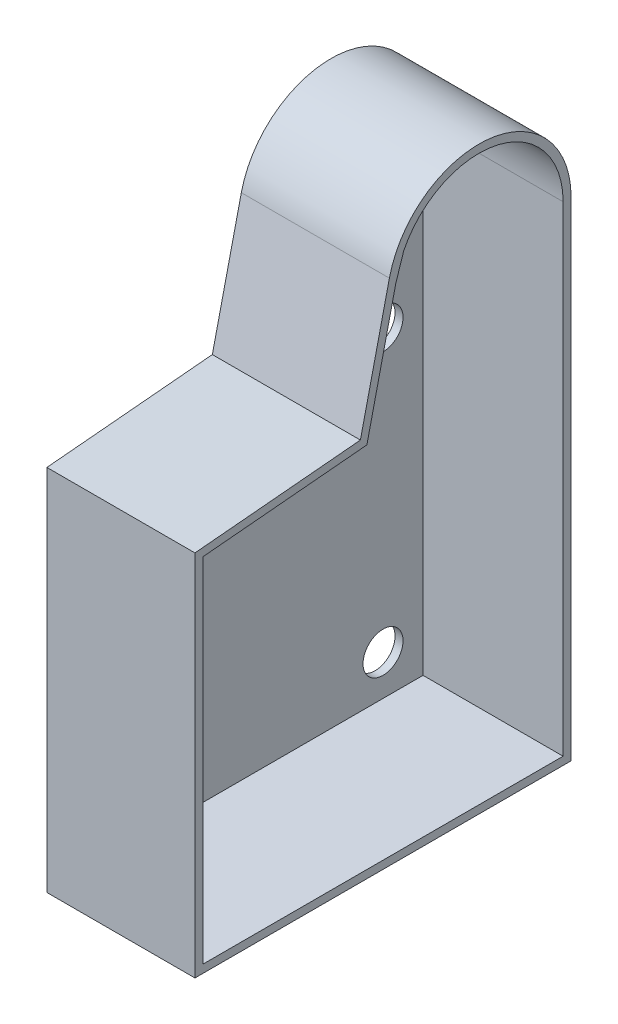
ISO-10303-21;
HEADER;
FILE_DESCRIPTION(('STEP AP214'),'2;1');
FILE_NAME('part.step','',(''),(''),'','','');
FILE_SCHEMA(('AUTOMOTIVE_DESIGN { 1 0 10303 214 1 1 1 1 }'));
ENDSEC;
DATA;
#1=APPLICATION_CONTEXT('core data for automotive mechanical design processes');
#2=APPLICATION_PROTOCOL_DEFINITION('international standard','automotive_design',2000,#1);
#3=PRODUCT_CONTEXT('',#1,'mechanical');
#4=PRODUCT('Part','Part','',(#3));
#5=PRODUCT_RELATED_PRODUCT_CATEGORY('part','',(#4));
#6=PRODUCT_DEFINITION_FORMATION('','',#4);
#7=PRODUCT_DEFINITION_CONTEXT('part definition',#1,'design');
#8=PRODUCT_DEFINITION('design','',#6,#7);
#9=PRODUCT_DEFINITION_SHAPE('','',#8);
#10=(LENGTH_UNIT() NAMED_UNIT(*) SI_UNIT(.MILLI.,.METRE.));
#11=(NAMED_UNIT(*) PLANE_ANGLE_UNIT() SI_UNIT($,.RADIAN.));
#12=(NAMED_UNIT(*) SI_UNIT($,.STERADIAN.) SOLID_ANGLE_UNIT());
#13=UNCERTAINTY_MEASURE_WITH_UNIT(LENGTH_MEASURE(1.E-05),#10,'distance_accuracy_value','');
#14=(GEOMETRIC_REPRESENTATION_CONTEXT(3) GLOBAL_UNCERTAINTY_ASSIGNED_CONTEXT((#13)) GLOBAL_UNIT_ASSIGNED_CONTEXT((#10,
#11,#12)) REPRESENTATION_CONTEXT('',''));
#15=CARTESIAN_POINT('',(0.,0.,0.));
#16=DIRECTION('',(0.,0.,1.));
#17=DIRECTION('',(1.,0.,0.));
#18=AXIS2_PLACEMENT_3D('',#15,#16,#17);
#19=CARTESIAN_POINT('',(0.,62.2628402000038,-26.0439329469259));
#20=DIRECTION('',(1.,0.,0.));
#21=DIRECTION('',(0.,0.,-1.));
#22=AXIS2_PLACEMENT_3D('',#19,#20,#21);
#23=PLANE('',#22);
#24=CARTESIAN_POINT('',(0.,22.2628402000404,-37.0439329470368));
#25=DIRECTION('',(1.,0.,0.));
#26=DIRECTION('',(0.,0.,-1.));
#27=AXIS2_PLACEMENT_3D('',#24,#25,#26);
#28=CIRCLE('',#27,5.00000000000455);
#29=CARTESIAN_POINT('',(0.,22.2628402000404,-42.0439329470414));
#30=VERTEX_POINT('',#29);
#31=EDGE_CURVE('E271',#30,#30,#28,.T.);
#32=ORIENTED_EDGE('',*,*,#31,.F.);
#33=EDGE_LOOP('',(#32));
#34=FACE_BOUND('',#33,.T.);
#35=CARTESIAN_POINT('',(0.,-47.7371597999596,-37.0439329470368));
#36=DIRECTION('',(1.,0.,0.));
#37=DIRECTION('',(0.,0.,-1.));
#38=AXIS2_PLACEMENT_3D('',#35,#36,#37);
#39=CIRCLE('',#38,5.00000000000458);
#40=CARTESIAN_POINT('',(0.,-47.7371597999596,-42.0439329470414));
#41=VERTEX_POINT('',#40);
#42=EDGE_CURVE('E265',#41,#41,#39,.T.);
#43=ORIENTED_EDGE('',*,*,#42,.F.);
#44=EDGE_LOOP('',(#43));
#45=FACE_BOUND('',#44,.T.);
#46=CARTESIAN_POINT('',(0.,-47.7371597999596,32.9560670529632));
#47=DIRECTION('',(1.,0.,0.));
#48=DIRECTION('',(0.,0.,-1.));
#49=AXIS2_PLACEMENT_3D('',#46,#47,#48);
#50=CIRCLE('',#49,5.00000000000456);
#51=CARTESIAN_POINT('',(0.,-47.7371597999596,27.9560670529586));
#52=VERTEX_POINT('',#51);
#53=EDGE_CURVE('E259',#52,#52,#50,.T.);
#54=ORIENTED_EDGE('',*,*,#53,.F.);
#55=EDGE_LOOP('',(#54));
#56=FACE_BOUND('',#55,.T.);
#57=CARTESIAN_POINT('',(0.,22.2628402000404,32.9560670529632));
#58=DIRECTION('',(1.,0.,0.));
#59=DIRECTION('',(0.,0.,-1.));
#60=AXIS2_PLACEMENT_3D('',#57,#58,#59);
#61=CIRCLE('',#60,5.00000000000456);
#62=CARTESIAN_POINT('',(0.,22.2628402000404,27.9560670529586));
#63=VERTEX_POINT('',#62);
#64=EDGE_CURVE('E242',#63,#63,#61,.T.);
#65=ORIENTED_EDGE('',*,*,#64,.F.);
#66=EDGE_LOOP('',(#65));
#67=FACE_BOUND('',#66,.T.);
#68=CARTESIAN_POINT('',(0.,62.2628402000038,-26.0439329469259));
#69=DIRECTION('',(1.,0.,0.));
#70=DIRECTION('',(0.,0.,-1.));
#71=AXIS2_PLACEMENT_3D('',#68,#69,#70);
#72=CIRCLE('',#71,21.000000000111);
#73=CARTESIAN_POINT('',(0.,71.5718826042402,-7.21996605573128));
#74=VERTEX_POINT('',#73);
#75=CARTESIAN_POINT('',(0.,62.2628402000404,-47.0439329470368));
#76=VERTEX_POINT('',#75);
#77=EDGE_CURVE('E224',#74,#76,#72,.F.);
#78=ORIENTED_EDGE('',*,*,#77,.F.);
#79=DIRECTION('',(0.,0.950386311679285,-0.311072111531465));
#80=VECTOR('',#79,1.);
#81=CARTESIAN_POINT('',(0.,65.5698078906343,-5.25541960573879));
#82=LINE('',#81,#80);
#83=CARTESIAN_POINT('',(0.,65.5698078906343,-5.2554196057388));
#84=VERTEX_POINT('',#83);
#85=EDGE_CURVE('E247',#84,#74,#82,.T.);
#86=ORIENTED_EDGE('',*,*,#85,.F.);
#87=DIRECTION('',(0.,0.974430327879,-0.224689866504087));
#88=VECTOR('',#87,1.);
#89=CARTESIAN_POINT('',(0.,35.5653537495854,1.66318360538522));
#90=LINE('',#89,#88);
#91=CARTESIAN_POINT('',(0.,34.1538342436052,1.98866006100515));
#92=VERTEX_POINT('',#91);
#93=EDGE_CURVE('E221',#92,#84,#90,.T.);
#94=ORIENTED_EDGE('',*,*,#93,.F.);
#95=DIRECTION('',(0.,0.0903767692441889,-0.995907646110312));
#96=VECTOR('',#95,1.);
#97=CARTESIAN_POINT('',(0.,30.4361181454251,42.9560670529631));
#98=LINE('',#97,#96);
#99=CARTESIAN_POINT('',(0.,30.4361181454251,42.9560670529631));
#100=VERTEX_POINT('',#99);
#101=EDGE_CURVE('E250',#100,#92,#98,.T.);
#102=ORIENTED_EDGE('',*,*,#101,.F.);
#103=DIRECTION('',(0.,1.,0.));
#104=VECTOR('',#103,1.);
#105=CARTESIAN_POINT('',(0.,-59.7371597999596,42.9560670529631));
#106=LINE('',#105,#104);
#107=CARTESIAN_POINT('',(0.,-57.7371597999596,42.9560670529631));
#108=VERTEX_POINT('',#107);
#109=EDGE_CURVE('E91',#108,#100,#106,.T.);
#110=ORIENTED_EDGE('',*,*,#109,.F.);
#111=DIRECTION('',(0.,0.,1.));
#112=VECTOR('',#111,1.);
#113=CARTESIAN_POINT('',(0.,-57.7371597999596,-49.0439329470368));
#114=LINE('',#113,#112);
#115=CARTESIAN_POINT('',(0.,-57.7371597999596,-47.0439329470368));
#116=VERTEX_POINT('',#115);
#117=EDGE_CURVE('E202',#116,#108,#114,.T.);
#118=ORIENTED_EDGE('',*,*,#117,.F.);
#119=DIRECTION('',(0.,1.,0.));
#120=VECTOR('',#119,1.);
#121=CARTESIAN_POINT('',(0.,-59.7371597999596,-47.0439329470368));
#122=LINE('',#121,#120);
#123=EDGE_CURVE('E226',#76,#116,#122,.F.);
#124=ORIENTED_EDGE('',*,*,#123,.F.);
#125=EDGE_LOOP('',(#78,#86,#94,#102,#110,#118,#124));
#126=FACE_BOUND('',#125,.T.);
#127=ADVANCED_FACE('F74',(#34,#45,#56,#67,#126),#23,.T.);
#128=CARTESIAN_POINT('',(-2.,-59.7371597999596,-49.0439329470368));
#129=DIRECTION('',(0.,0.,-1.));
#130=DIRECTION('',(-1.,0.,0.));
#131=AXIS2_PLACEMENT_3D('',#128,#129,#130);
#132=PLANE('',#131);
#133=DIRECTION('',(1.,0.,0.));
#134=VECTOR('',#133,1.);
#135=CARTESIAN_POINT('',(-2.,62.2628402000404,-49.0439329470368));
#136=LINE('',#135,#134);
#137=CARTESIAN_POINT('',(-2.,62.2628402000404,-49.0439329470368));
#138=VERTEX_POINT('',#137);
#139=CARTESIAN_POINT('',(35.,62.2628402000404,-49.0439329470368));
#140=VERTEX_POINT('',#139);
#141=EDGE_CURVE('E78',#138,#140,#136,.T.);
#142=ORIENTED_EDGE('',*,*,#141,.T.);
#143=DIRECTION('',(0.,-1.,0.));
#144=VECTOR('',#143,1.);
#145=CARTESIAN_POINT('',(35.,-59.7371597999596,-49.0439329470368));
#146=LINE('',#145,#144);
#147=CARTESIAN_POINT('',(35.,-59.7371597999596,-49.0439329470368));
#148=VERTEX_POINT('',#147);
#149=EDGE_CURVE('E199',#140,#148,#146,.T.);
#150=ORIENTED_EDGE('',*,*,#149,.T.);
#151=DIRECTION('',(1.,0.,0.));
#152=VECTOR('',#151,1.);
#153=CARTESIAN_POINT('',(-2.,-59.7371597999596,-49.0439329470368));
#154=LINE('',#153,#152);
#155=CARTESIAN_POINT('',(-2.,-59.7371597999596,-49.0439329470368));
#156=VERTEX_POINT('',#155);
#157=EDGE_CURVE('E12',#156,#148,#154,.T.);
#158=ORIENTED_EDGE('',*,*,#157,.F.);
#159=DIRECTION('',(0.,1.,0.));
#160=VECTOR('',#159,1.);
#161=CARTESIAN_POINT('',(-2.,-59.7371597999596,-49.0439329470368));
#162=LINE('',#161,#160);
#163=EDGE_CURVE('E277',#156,#138,#162,.T.);
#164=ORIENTED_EDGE('',*,*,#163,.T.);
#165=EDGE_LOOP('',(#142,#150,#158,#164));
#166=FACE_BOUND('',#165,.T.);
#167=ADVANCED_FACE('F76',(#166),#132,.T.);
#168=CARTESIAN_POINT('',(-2.,-59.7371597999596,-49.0439329470368));
#169=DIRECTION('',(0.,-1.,0.));
#170=DIRECTION('',(0.,0.,-1.));
#171=AXIS2_PLACEMENT_3D('',#168,#169,#170);
#172=PLANE('',#171);
#173=ORIENTED_EDGE('',*,*,#157,.T.);
#174=DIRECTION('',(0.,0.,1.));
#175=VECTOR('',#174,1.);
#176=CARTESIAN_POINT('',(35.,-59.7371597999596,-49.0439329470368));
#177=LINE('',#176,#175);
#178=CARTESIAN_POINT('',(35.,-59.7371597999596,44.9560670529631));
#179=VERTEX_POINT('',#178);
#180=EDGE_CURVE('E196',#148,#179,#177,.T.);
#181=ORIENTED_EDGE('',*,*,#180,.T.);
#182=DIRECTION('',(1.,0.,0.));
#183=VECTOR('',#182,1.);
#184=CARTESIAN_POINT('',(-2.,-59.7371597999596,44.9560670529631));
#185=LINE('',#184,#183);
#186=CARTESIAN_POINT('',(-2.,-59.7371597999596,44.9560670529631));
#187=VERTEX_POINT('',#186);
#188=EDGE_CURVE('E83',#187,#179,#185,.T.);
#189=ORIENTED_EDGE('',*,*,#188,.F.);
#190=DIRECTION('',(0.,0.,-1.));
#191=VECTOR('',#190,1.);
#192=CARTESIAN_POINT('',(-2.,-59.7371597999596,-49.0439329470368));
#193=LINE('',#192,#191);
#194=EDGE_CURVE('E290',#187,#156,#193,.T.);
#195=ORIENTED_EDGE('',*,*,#194,.T.);
#196=EDGE_LOOP('',(#173,#181,#189,#195));
#197=FACE_BOUND('',#196,.T.);
#198=ADVANCED_FACE('F300',(#197),#172,.T.);
#199=CARTESIAN_POINT('',(-2.,-59.7371597999596,44.9560670529631));
#200=DIRECTION('',(0.,0.,1.));
#201=DIRECTION('',(1.,0.,0.));
#202=AXIS2_PLACEMENT_3D('',#199,#200,#201);
#203=PLANE('',#202);
#204=ORIENTED_EDGE('',*,*,#188,.T.);
#205=DIRECTION('',(0.,1.,0.));
#206=VECTOR('',#205,1.);
#207=CARTESIAN_POINT('',(35.,-59.7371597999596,44.9560670529631));
#208=LINE('',#207,#206);
#209=CARTESIAN_POINT('',(35.,32.2628402000423,44.9560670529631));
#210=VERTEX_POINT('',#209);
#211=EDGE_CURVE('E189',#179,#210,#208,.T.);
#212=ORIENTED_EDGE('',*,*,#211,.T.);
#213=DIRECTION('',(1.,0.,0.));
#214=VECTOR('',#213,1.);
#215=CARTESIAN_POINT('',(-2.,32.2628402000423,44.9560670529631));
#216=LINE('',#215,#214);
#217=CARTESIAN_POINT('',(-2.,32.2628402000423,44.9560670529631));
#218=VERTEX_POINT('',#217);
#219=EDGE_CURVE('E171',#218,#210,#216,.T.);
#220=ORIENTED_EDGE('',*,*,#219,.F.);
#221=DIRECTION('',(0.,-1.,0.));
#222=VECTOR('',#221,1.);
#223=CARTESIAN_POINT('',(-2.,-59.7371597999596,44.9560670529631));
#224=LINE('',#223,#222);
#225=EDGE_CURVE('E288',#218,#187,#224,.T.);
#226=ORIENTED_EDGE('',*,*,#225,.T.);
#227=EDGE_LOOP('',(#204,#212,#220,#226));
#228=FACE_BOUND('',#227,.T.);
#229=ADVANCED_FACE('F195',(#228),#203,.T.);
#230=CARTESIAN_POINT('',(-2.,32.2628402000423,44.9560670529631));
#231=DIRECTION('',(0.,0.995907646110312,0.0903767692441889));
#232=DIRECTION('',(0.,-0.090376769244189,0.995907646110312));
#233=AXIS2_PLACEMENT_3D('',#230,#231,#232);
#234=PLANE('',#233);
#235=ORIENTED_EDGE('',*,*,#219,.T.);
#236=DIRECTION('',(0.,0.0903767692441889,-0.995907646110312));
#237=VECTOR('',#236,1.);
#238=CARTESIAN_POINT('',(35.,32.4279334376457,43.1368205914515));
#239=LINE('',#238,#237);
#240=CARTESIAN_POINT('',(35.,36.0147334825936,3.61204426114322));
#241=VERTEX_POINT('',#240);
#242=EDGE_CURVE('E174',#210,#241,#239,.T.);
#243=ORIENTED_EDGE('',*,*,#242,.T.);
#244=DIRECTION('',(1.,0.,0.));
#245=VECTOR('',#244,1.);
#246=CARTESIAN_POINT('',(-2.,36.0147334825936,3.61204426114322));
#247=LINE('',#246,#245);
#248=CARTESIAN_POINT('',(-2.,36.0147334825936,3.61204426114322));
#249=VERTEX_POINT('',#248);
#250=EDGE_CURVE('E182',#249,#241,#247,.T.);
#251=ORIENTED_EDGE('',*,*,#250,.F.);
#252=DIRECTION('',(0.,-0.090376769244189,0.995907646110312));
#253=VECTOR('',#252,1.);
#254=CARTESIAN_POINT('',(-2.,32.2628402000423,44.9560670529631));
#255=LINE('',#254,#253);
#256=EDGE_CURVE('E177',#249,#218,#255,.T.);
#257=ORIENTED_EDGE('',*,*,#256,.T.);
#258=EDGE_LOOP('',(#235,#243,#251,#257));
#259=FACE_BOUND('',#258,.T.);
#260=ADVANCED_FACE('F173',(#259),#234,.T.);
#261=CARTESIAN_POINT('',(-2.,67.4307071296228,-3.63203540560073));
#262=DIRECTION('',(0.,0.224689866504087,0.974430327879));
#263=DIRECTION('',(0.,-0.974430327879,0.224689866504087));
#264=AXIS2_PLACEMENT_3D('',#261,#262,#263);
#265=PLANE('',#264);
#266=ORIENTED_EDGE('',*,*,#250,.T.);
#267=DIRECTION('',(0.,0.974430327879,-0.224689866504087));
#268=VECTOR('',#267,1.);
#269=CARTESIAN_POINT('',(35.,36.0147334825936,3.61204426114322));
#270=LINE('',#269,#268);
#271=CARTESIAN_POINT('',(35.,67.4307071296228,-3.63203540560073));
#272=VERTEX_POINT('',#271);
#273=EDGE_CURVE('E192',#241,#272,#270,.T.);
#274=ORIENTED_EDGE('',*,*,#273,.T.);
#275=DIRECTION('',(1.,0.,0.));
#276=VECTOR('',#275,1.);
#277=CARTESIAN_POINT('',(-2.,67.4307071296228,-3.63203540560073));
#278=LINE('',#277,#276);
#279=CARTESIAN_POINT('',(-2.,67.4307071296228,-3.63203540560073));
#280=VERTEX_POINT('',#279);
#281=EDGE_CURVE('E294',#280,#272,#278,.T.);
#282=ORIENTED_EDGE('',*,*,#281,.F.);
#283=DIRECTION('',(0.,-0.974430327879,0.224689866504087));
#284=VECTOR('',#283,1.);
#285=CARTESIAN_POINT('',(-2.,67.4307071296228,-3.63203540560073));
#286=LINE('',#285,#284);
#287=EDGE_CURVE('E284',#280,#249,#286,.T.);
#288=ORIENTED_EDGE('',*,*,#287,.T.);
#289=EDGE_LOOP('',(#266,#274,#282,#288));
#290=FACE_BOUND('',#289,.T.);
#291=ADVANCED_FACE('F306',(#290),#265,.T.);
#292=CARTESIAN_POINT('',(-2.,62.2628402000038,-26.0439329469259));
#293=DIRECTION('',(1.,0.,0.));
#294=DIRECTION('',(0.,0.,-1.));
#295=AXIS2_PLACEMENT_3D('',#292,#293,#294);
#296=CYLINDRICAL_SURFACE('',#295,23.000000000111);
#297=ORIENTED_EDGE('',*,*,#281,.T.);
#298=CARTESIAN_POINT('',(35.,62.2628402000038,-26.0439329469259));
#299=DIRECTION('',(-1.,0.,0.));
#300=DIRECTION('',(0.,0.,-1.));
#301=AXIS2_PLACEMENT_3D('',#298,#299,#300);
#302=CIRCLE('',#301,23.000000000111);
#303=EDGE_CURVE('E206',#272,#140,#302,.T.);
#304=ORIENTED_EDGE('',*,*,#303,.T.);
#305=ORIENTED_EDGE('',*,*,#141,.F.);
#306=CARTESIAN_POINT('',(-2.,62.2628402000038,-26.0439329469259));
#307=DIRECTION('',(1.,0.,0.));
#308=DIRECTION('',(0.,0.,-1.));
#309=AXIS2_PLACEMENT_3D('',#306,#307,#308);
#310=CIRCLE('',#309,23.000000000111);
#311=EDGE_CURVE('E281',#138,#280,#310,.T.);
#312=ORIENTED_EDGE('',*,*,#311,.T.);
#313=EDGE_LOOP('',(#297,#304,#305,#312));
#314=FACE_BOUND('',#313,.T.);
#315=ADVANCED_FACE('F298',(#314),#296,.T.);
#316=CARTESIAN_POINT('',(-2.,62.2628402000038,-26.0439329469259));
#317=DIRECTION('',(1.,0.,0.));
#318=DIRECTION('',(0.,0.,-1.));
#319=AXIS2_PLACEMENT_3D('',#316,#317,#318);
#320=PLANE('',#319);
#321=CARTESIAN_POINT('',(-2.,22.2628402000404,32.9560670529632));
#322=DIRECTION('',(1.,0.,0.));
#323=DIRECTION('',(0.,0.,-1.));
#324=AXIS2_PLACEMENT_3D('',#321,#322,#323);
#325=CIRCLE('',#324,5.00000000000456);
#326=CARTESIAN_POINT('',(-2.,22.2628402000404,27.9560670529586));
#327=VERTEX_POINT('',#326);
#328=EDGE_CURVE('E256',#327,#327,#325,.T.);
#329=ORIENTED_EDGE('',*,*,#328,.T.);
#330=EDGE_LOOP('',(#329));
#331=FACE_BOUND('',#330,.T.);
#332=CARTESIAN_POINT('',(-2.,-47.7371597999596,32.9560670529632));
#333=DIRECTION('',(1.,0.,0.));
#334=DIRECTION('',(0.,0.,-1.));
#335=AXIS2_PLACEMENT_3D('',#332,#333,#334);
#336=CIRCLE('',#335,5.00000000000456);
#337=CARTESIAN_POINT('',(-2.,-47.7371597999596,27.9560670529586));
#338=VERTEX_POINT('',#337);
#339=EDGE_CURVE('E262',#338,#338,#336,.T.);
#340=ORIENTED_EDGE('',*,*,#339,.T.);
#341=EDGE_LOOP('',(#340));
#342=FACE_BOUND('',#341,.T.);
#343=CARTESIAN_POINT('',(-2.,-47.7371597999596,-37.0439329470368));
#344=DIRECTION('',(1.,0.,0.));
#345=DIRECTION('',(0.,0.,-1.));
#346=AXIS2_PLACEMENT_3D('',#343,#344,#345);
#347=CIRCLE('',#346,5.00000000000458);
#348=CARTESIAN_POINT('',(-2.,-47.7371597999596,-42.0439329470414));
#349=VERTEX_POINT('',#348);
#350=EDGE_CURVE('E268',#349,#349,#347,.T.);
#351=ORIENTED_EDGE('',*,*,#350,.T.);
#352=EDGE_LOOP('',(#351));
#353=FACE_BOUND('',#352,.T.);
#354=CARTESIAN_POINT('',(-2.,22.2628402000404,-37.0439329470368));
#355=DIRECTION('',(1.,0.,0.));
#356=DIRECTION('',(0.,0.,-1.));
#357=AXIS2_PLACEMENT_3D('',#354,#355,#356);
#358=CIRCLE('',#357,5.00000000000455);
#359=CARTESIAN_POINT('',(-2.,22.2628402000404,-42.0439329470414));
#360=VERTEX_POINT('',#359);
#361=EDGE_CURVE('E274',#360,#360,#358,.T.);
#362=ORIENTED_EDGE('',*,*,#361,.T.);
#363=EDGE_LOOP('',(#362));
#364=FACE_BOUND('',#363,.T.);
#365=ORIENTED_EDGE('',*,*,#163,.F.);
#366=ORIENTED_EDGE('',*,*,#194,.F.);
#367=ORIENTED_EDGE('',*,*,#225,.F.);
#368=ORIENTED_EDGE('',*,*,#256,.F.);
#369=ORIENTED_EDGE('',*,*,#287,.F.);
#370=ORIENTED_EDGE('',*,*,#311,.F.);
#371=EDGE_LOOP('',(#365,#366,#367,#368,#369,#370));
#372=FACE_BOUND('',#371,.T.);
#373=ADVANCED_FACE('F303',(#331,#342,#353,#364,#372),#320,.F.);
#374=CARTESIAN_POINT('',(-2.,22.2628402000404,-37.0439329470368));
#375=DIRECTION('',(1.,0.,0.));
#376=DIRECTION('',(0.,0.,-1.));
#377=AXIS2_PLACEMENT_3D('',#374,#375,#376);
#378=CYLINDRICAL_SURFACE('',#377,5.00000000000455);
#379=ORIENTED_EDGE('',*,*,#361,.F.);
#380=EDGE_LOOP('',(#379));
#381=FACE_BOUND('',#380,.T.);
#382=ORIENTED_EDGE('',*,*,#31,.T.);
#383=EDGE_LOOP('',(#382));
#384=FACE_BOUND('',#383,.T.);
#385=ADVANCED_FACE('F448',(#381,#384),#378,.F.);
#386=CARTESIAN_POINT('',(-2.,-47.7371597999596,-37.0439329470368));
#387=DIRECTION('',(1.,0.,0.));
#388=DIRECTION('',(0.,0.,-1.));
#389=AXIS2_PLACEMENT_3D('',#386,#387,#388);
#390=CYLINDRICAL_SURFACE('',#389,5.00000000000458);
#391=ORIENTED_EDGE('',*,*,#350,.F.);
#392=EDGE_LOOP('',(#391));
#393=FACE_BOUND('',#392,.T.);
#394=ORIENTED_EDGE('',*,*,#42,.T.);
#395=EDGE_LOOP('',(#394));
#396=FACE_BOUND('',#395,.T.);
#397=ADVANCED_FACE('F445',(#393,#396),#390,.F.);
#398=CARTESIAN_POINT('',(-2.,-47.7371597999596,32.9560670529632));
#399=DIRECTION('',(1.,0.,0.));
#400=DIRECTION('',(0.,0.,-1.));
#401=AXIS2_PLACEMENT_3D('',#398,#399,#400);
#402=CYLINDRICAL_SURFACE('',#401,5.00000000000456);
#403=ORIENTED_EDGE('',*,*,#339,.F.);
#404=EDGE_LOOP('',(#403));
#405=FACE_BOUND('',#404,.T.);
#406=ORIENTED_EDGE('',*,*,#53,.T.);
#407=EDGE_LOOP('',(#406));
#408=FACE_BOUND('',#407,.T.);
#409=ADVANCED_FACE('F441',(#405,#408),#402,.F.);
#410=CARTESIAN_POINT('',(-2.,22.2628402000404,32.9560670529632));
#411=DIRECTION('',(1.,0.,0.));
#412=DIRECTION('',(0.,0.,-1.));
#413=AXIS2_PLACEMENT_3D('',#410,#411,#412);
#414=CYLINDRICAL_SURFACE('',#413,5.00000000000456);
#415=ORIENTED_EDGE('',*,*,#328,.F.);
#416=EDGE_LOOP('',(#415));
#417=FACE_BOUND('',#416,.T.);
#418=ORIENTED_EDGE('',*,*,#64,.T.);
#419=EDGE_LOOP('',(#418));
#420=FACE_BOUND('',#419,.T.);
#421=ADVANCED_FACE('F362',(#417,#420),#414,.F.);
#422=CARTESIAN_POINT('',(35.,35.5653537495854,1.66318360538522));
#423=DIRECTION('',(0.,0.224689866504087,0.974430327879));
#424=DIRECTION('',(0.,-0.974430327879,0.224689866504087));
#425=AXIS2_PLACEMENT_3D('',#422,#423,#424);
#426=PLANE('',#425);
#427=DIRECTION('',(-1.,0.,0.));
#428=VECTOR('',#427,1.);
#429=CARTESIAN_POINT('',(35.,65.5698078906343,-5.2554196057388));
#430=LINE('',#429,#428);
#431=CARTESIAN_POINT('',(35.,65.5698078906343,-5.2554196057388));
#432=VERTEX_POINT('',#431);
#433=EDGE_CURVE('E238',#432,#84,#430,.T.);
#434=ORIENTED_EDGE('',*,*,#433,.F.);
#435=DIRECTION('',(0.,0.974430327879,-0.224689866504087));
#436=VECTOR('',#435,1.);
#437=CARTESIAN_POINT('',(35.,35.5653537495854,1.66318360538522));
#438=LINE('',#437,#436);
#439=CARTESIAN_POINT('',(35.,34.1538342436052,1.98866006100515));
#440=VERTEX_POINT('',#439);
#441=EDGE_CURVE('E210',#440,#432,#438,.T.);
#442=ORIENTED_EDGE('',*,*,#441,.F.);
#443=DIRECTION('',(-1.,0.,0.));
#444=VECTOR('',#443,1.);
#445=CARTESIAN_POINT('',(35.,34.1538342436052,1.98866006100515));
#446=LINE('',#445,#444);
#447=EDGE_CURVE('E193',#440,#92,#446,.T.);
#448=ORIENTED_EDGE('',*,*,#447,.T.);
#449=ORIENTED_EDGE('',*,*,#93,.T.);
#450=EDGE_LOOP('',(#434,#442,#448,#449));
#451=FACE_BOUND('',#450,.T.);
#452=ADVANCED_FACE('F356',(#451),#426,.F.);
#453=CARTESIAN_POINT('',(35.,62.2628402000038,-26.0439329469259));
#454=DIRECTION('',(-1.,0.,0.));
#455=DIRECTION('',(0.,0.,1.));
#456=AXIS2_PLACEMENT_3D('',#453,#454,#455);
#457=CYLINDRICAL_SURFACE('',#456,21.000000000111);
#458=DIRECTION('',(-1.,0.,0.));
#459=VECTOR('',#458,1.);
#460=CARTESIAN_POINT('',(35.,71.5718826042402,-7.2199660557313));
#461=LINE('',#460,#459);
#462=CARTESIAN_POINT('',(35.,71.5718826042402,-7.21996605573128));
#463=VERTEX_POINT('',#462);
#464=EDGE_CURVE('E236',#74,#463,#461,.F.);
#465=ORIENTED_EDGE('',*,*,#464,.F.);
#466=ORIENTED_EDGE('',*,*,#77,.T.);
#467=DIRECTION('',(-1.,0.,0.));
#468=VECTOR('',#467,1.);
#469=CARTESIAN_POINT('',(35.,62.2628402000404,-47.0439329470368));
#470=LINE('',#469,#468);
#471=CARTESIAN_POINT('',(35.,62.2628402000404,-47.0439329470368));
#472=VERTEX_POINT('',#471);
#473=EDGE_CURVE('E233',#472,#76,#470,.T.);
#474=ORIENTED_EDGE('',*,*,#473,.F.);
#475=CARTESIAN_POINT('',(35.,62.2628402000038,-26.0439329469259));
#476=DIRECTION('',(1.,0.,0.));
#477=DIRECTION('',(0.,0.,-1.));
#478=AXIS2_PLACEMENT_3D('',#475,#476,#477);
#479=CIRCLE('',#478,21.000000000111);
#480=EDGE_CURVE('E213',#463,#472,#479,.F.);
#481=ORIENTED_EDGE('',*,*,#480,.F.);
#482=EDGE_LOOP('',(#465,#466,#474,#481));
#483=FACE_BOUND('',#482,.T.);
#484=ADVANCED_FACE('F361',(#483),#457,.F.);
#485=CARTESIAN_POINT('',(35.,-59.7371597999596,-47.0439329470368));
#486=DIRECTION('',(0.,0.,-1.));
#487=DIRECTION('',(-1.,0.,0.));
#488=AXIS2_PLACEMENT_3D('',#485,#486,#487);
#489=PLANE('',#488);
#490=ORIENTED_EDGE('',*,*,#123,.T.);
#491=DIRECTION('',(-1.,0.,0.));
#492=VECTOR('',#491,1.);
#493=CARTESIAN_POINT('',(35.,-57.7371597999596,-47.0439329470368));
#494=LINE('',#493,#492);
#495=CARTESIAN_POINT('',(35.,-57.7371597999596,-47.0439329470368));
#496=VERTEX_POINT('',#495);
#497=EDGE_CURVE('E230',#496,#116,#494,.T.);
#498=ORIENTED_EDGE('',*,*,#497,.F.);
#499=DIRECTION('',(0.,1.,0.));
#500=VECTOR('',#499,1.);
#501=CARTESIAN_POINT('',(35.,-59.7371597999596,-47.0439329470368));
#502=LINE('',#501,#500);
#503=EDGE_CURVE('E215',#472,#496,#502,.F.);
#504=ORIENTED_EDGE('',*,*,#503,.F.);
#505=ORIENTED_EDGE('',*,*,#473,.T.);
#506=EDGE_LOOP('',(#490,#498,#504,#505));
#507=FACE_BOUND('',#506,.T.);
#508=ADVANCED_FACE('F374',(#507),#489,.F.);
#509=CARTESIAN_POINT('',(35.,-57.7371597999596,-49.0439329470368));
#510=DIRECTION('',(0.,-1.,0.));
#511=DIRECTION('',(0.,0.,-1.));
#512=AXIS2_PLACEMENT_3D('',#509,#510,#511);
#513=PLANE('',#512);
#514=ORIENTED_EDGE('',*,*,#117,.T.);
#515=DIRECTION('',(-1.,0.,0.));
#516=VECTOR('',#515,1.);
#517=CARTESIAN_POINT('',(35.,-57.7371597999596,42.9560670529631));
#518=LINE('',#517,#516);
#519=CARTESIAN_POINT('',(35.,-57.7371597999596,42.9560670529631));
#520=VERTEX_POINT('',#519);
#521=EDGE_CURVE('E219',#520,#108,#518,.T.);
#522=ORIENTED_EDGE('',*,*,#521,.F.);
#523=DIRECTION('',(0.,0.,1.));
#524=VECTOR('',#523,1.);
#525=CARTESIAN_POINT('',(35.,-57.7371597999596,-49.0439329470368));
#526=LINE('',#525,#524);
#527=EDGE_CURVE('E217',#496,#520,#526,.T.);
#528=ORIENTED_EDGE('',*,*,#527,.F.);
#529=ORIENTED_EDGE('',*,*,#497,.T.);
#530=EDGE_LOOP('',(#514,#522,#528,#529));
#531=FACE_BOUND('',#530,.T.);
#532=ADVANCED_FACE('F385',(#531),#513,.F.);
#533=CARTESIAN_POINT('',(35.,-59.7371597999596,42.9560670529631));
#534=DIRECTION('',(0.,0.,1.));
#535=DIRECTION('',(1.,0.,0.));
#536=AXIS2_PLACEMENT_3D('',#533,#534,#535);
#537=PLANE('',#536);
#538=DIRECTION('',(-1.,0.,0.));
#539=VECTOR('',#538,1.);
#540=CARTESIAN_POINT('',(35.,30.4361181454251,42.9560670529631));
#541=LINE('',#540,#539);
#542=CARTESIAN_POINT('',(35.,30.4361181454251,42.9560670529631));
#543=VERTEX_POINT('',#542);
#544=EDGE_CURVE('E240',#543,#100,#541,.T.);
#545=ORIENTED_EDGE('',*,*,#544,.F.);
#546=DIRECTION('',(0.,1.,0.));
#547=VECTOR('',#546,1.);
#548=CARTESIAN_POINT('',(35.,-59.7371597999596,42.9560670529631));
#549=LINE('',#548,#547);
#550=EDGE_CURVE('E197',#520,#543,#549,.T.);
#551=ORIENTED_EDGE('',*,*,#550,.F.);
#552=ORIENTED_EDGE('',*,*,#521,.T.);
#553=ORIENTED_EDGE('',*,*,#109,.T.);
#554=EDGE_LOOP('',(#545,#551,#552,#553));
#555=FACE_BOUND('',#554,.T.);
#556=ADVANCED_FACE('F396',(#555),#537,.F.);
#557=CARTESIAN_POINT('',(35.,62.2628402000038,-26.0439329469259));
#558=DIRECTION('',(-1.,0.,0.));
#559=DIRECTION('',(0.,0.,1.));
#560=AXIS2_PLACEMENT_3D('',#557,#558,#559);
#561=PLANE('',#560);
#562=ORIENTED_EDGE('',*,*,#550,.T.);
#563=DIRECTION('',(0.,0.0903767692441889,-0.995907646110312));
#564=VECTOR('',#563,1.);
#565=CARTESIAN_POINT('',(35.,30.4361181454251,42.9560670529631));
#566=LINE('',#565,#564);
#567=EDGE_CURVE('E243',#543,#440,#566,.T.);
#568=ORIENTED_EDGE('',*,*,#567,.T.);
#569=ORIENTED_EDGE('',*,*,#441,.T.);
#570=DIRECTION('',(0.,0.950386311679285,-0.311072111531465));
#571=VECTOR('',#570,1.);
#572=CARTESIAN_POINT('',(35.,65.5698078906343,-5.25541960573879));
#573=LINE('',#572,#571);
#574=EDGE_CURVE('E246',#432,#463,#573,.T.);
#575=ORIENTED_EDGE('',*,*,#574,.T.);
#576=ORIENTED_EDGE('',*,*,#480,.T.);
#577=ORIENTED_EDGE('',*,*,#503,.T.);
#578=ORIENTED_EDGE('',*,*,#527,.T.);
#579=EDGE_LOOP('',(#562,#568,#569,#575,#576,#577,#578));
#580=FACE_BOUND('',#579,.T.);
#581=ORIENTED_EDGE('',*,*,#303,.F.);
#582=ORIENTED_EDGE('',*,*,#273,.F.);
#583=ORIENTED_EDGE('',*,*,#242,.F.);
#584=ORIENTED_EDGE('',*,*,#211,.F.);
#585=ORIENTED_EDGE('',*,*,#180,.F.);
#586=ORIENTED_EDGE('',*,*,#149,.F.);
#587=EDGE_LOOP('',(#581,#582,#583,#584,#585,#586));
#588=FACE_BOUND('',#587,.T.);
#589=ADVANCED_FACE('F187',(#580,#588),#561,.F.);
#590=CARTESIAN_POINT('',(35.,65.5698078906343,-5.25541960573879));
#591=DIRECTION('',(0.,0.311072111531465,0.950386311679285));
#592=DIRECTION('',(0.,-0.950386311679286,0.311072111531465));
#593=AXIS2_PLACEMENT_3D('',#590,#591,#592);
#594=PLANE('',#593);
#595=ORIENTED_EDGE('',*,*,#85,.T.);
#596=ORIENTED_EDGE('',*,*,#464,.T.);
#597=ORIENTED_EDGE('',*,*,#574,.F.);
#598=ORIENTED_EDGE('',*,*,#433,.T.);
#599=EDGE_LOOP('',(#595,#596,#597,#598));
#600=FACE_BOUND('',#599,.T.);
#601=ADVANCED_FACE('F415',(#600),#594,.F.);
#602=CARTESIAN_POINT('',(35.,30.4361181454251,42.9560670529631));
#603=DIRECTION('',(0.,0.995907646110312,0.0903767692441889));
#604=DIRECTION('',(0.,-0.0903767692441889,0.995907646110312));
#605=AXIS2_PLACEMENT_3D('',#602,#603,#604);
#606=PLANE('',#605);
#607=ORIENTED_EDGE('',*,*,#101,.T.);
#608=ORIENTED_EDGE('',*,*,#447,.F.);
#609=ORIENTED_EDGE('',*,*,#567,.F.);
#610=ORIENTED_EDGE('',*,*,#544,.T.);
#611=EDGE_LOOP('',(#607,#608,#609,#610));
#612=FACE_BOUND('',#611,.T.);
#613=ADVANCED_FACE('F425',(#612),#606,.F.);
#614=CLOSED_SHELL('',(#127,#167,#198,#229,#260,#291,#315,#373,#385,#397,#409,#421,#452,#484,
#508,#532,#556,#589,#601,#613));
#615=MANIFOLD_SOLID_BREP('B2',#614);
#616=ADVANCED_BREP_SHAPE_REPRESENTATION('',(#18,#615),#14);
#617=SHAPE_DEFINITION_REPRESENTATION(#9,#616);
ENDSEC;
END-ISO-10303-21;
